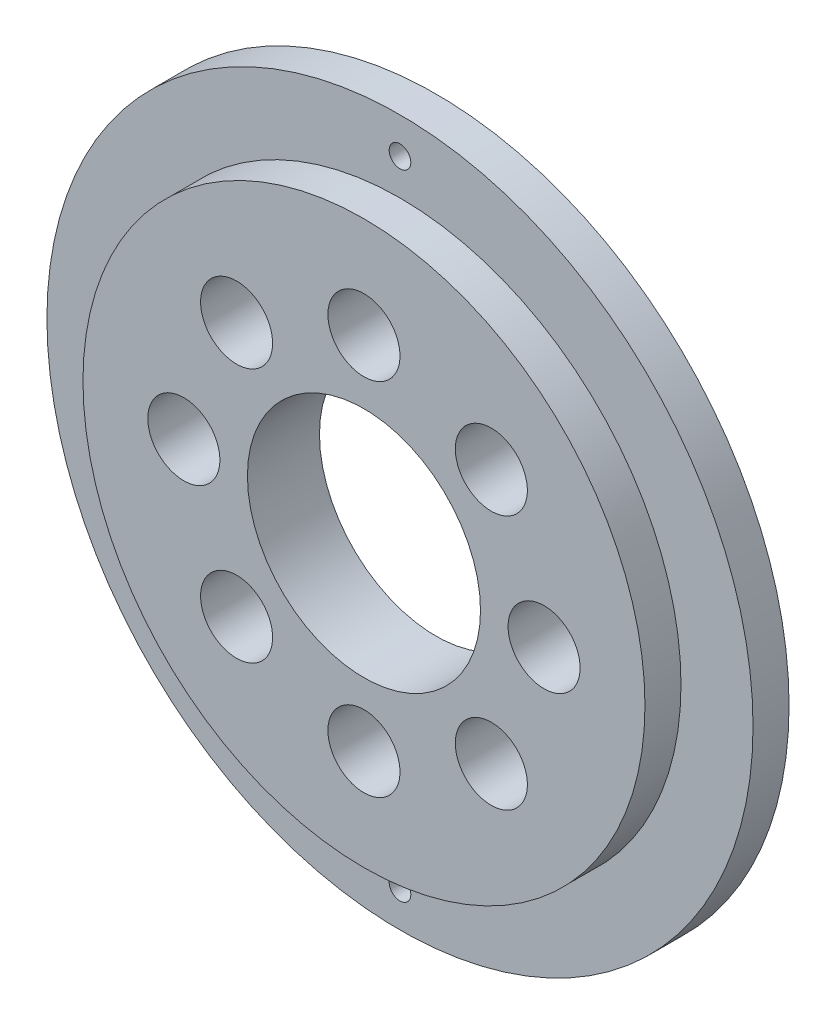
ISO-10303-21;
HEADER;
FILE_DESCRIPTION(('STEP AP214'),'2;1');
FILE_NAME('part.step','',(''),(''),'','','');
FILE_SCHEMA(('AUTOMOTIVE_DESIGN { 1 0 10303 214 1 1 1 1 }'));
ENDSEC;
DATA;
#1=APPLICATION_CONTEXT('core data for automotive mechanical design processes');
#2=APPLICATION_PROTOCOL_DEFINITION('international standard','automotive_design',2000,#1);
#3=PRODUCT_CONTEXT('',#1,'mechanical');
#4=PRODUCT('Part','Part','',(#3));
#5=PRODUCT_RELATED_PRODUCT_CATEGORY('part','',(#4));
#6=PRODUCT_DEFINITION_FORMATION('','',#4);
#7=PRODUCT_DEFINITION_CONTEXT('part definition',#1,'design');
#8=PRODUCT_DEFINITION('design','',#6,#7);
#9=PRODUCT_DEFINITION_SHAPE('','',#8);
#10=(LENGTH_UNIT() NAMED_UNIT(*) SI_UNIT(.MILLI.,.METRE.));
#11=(NAMED_UNIT(*) PLANE_ANGLE_UNIT() SI_UNIT($,.RADIAN.));
#12=(NAMED_UNIT(*) SI_UNIT($,.STERADIAN.) SOLID_ANGLE_UNIT());
#13=UNCERTAINTY_MEASURE_WITH_UNIT(LENGTH_MEASURE(1.E-05),#10,'distance_accuracy_value','');
#14=(GEOMETRIC_REPRESENTATION_CONTEXT(3) GLOBAL_UNCERTAINTY_ASSIGNED_CONTEXT((#13)) GLOBAL_UNIT_ASSIGNED_CONTEXT((#10,
#11,#12)) REPRESENTATION_CONTEXT('',''));
#15=CARTESIAN_POINT('',(0.,0.,0.));
#16=DIRECTION('',(0.,0.,1.));
#17=DIRECTION('',(1.,0.,0.));
#18=AXIS2_PLACEMENT_3D('',#15,#16,#17);
#19=CARTESIAN_POINT('',(0.,0.,5.));
#20=DIRECTION('',(0.,0.,1.));
#21=DIRECTION('',(1.,0.,0.));
#22=AXIS2_PLACEMENT_3D('',#19,#20,#21);
#23=PLANE('',#22);
#24=CARTESIAN_POINT('',(17.6776695296637,17.6776695296637,5.));
#25=DIRECTION('',(0.,0.,-1.));
#26=DIRECTION('',(-1.,0.,0.));
#27=AXIS2_PLACEMENT_3D('',#24,#25,#26);
#28=CIRCLE('',#27,5.);
#29=CARTESIAN_POINT('',(12.6776695296637,17.6776695296637,5.));
#30=VERTEX_POINT('',#29);
#31=EDGE_CURVE('E147',#30,#30,#28,.T.);
#32=ORIENTED_EDGE('',*,*,#31,.T.);
#33=EDGE_LOOP('',(#32));
#34=FACE_BOUND('',#33,.T.);
#35=CARTESIAN_POINT('',(-17.6776695296637,-17.6776695296637,5.));
#36=DIRECTION('',(0.,0.,-1.));
#37=DIRECTION('',(-1.,0.,0.));
#38=AXIS2_PLACEMENT_3D('',#35,#36,#37);
#39=CIRCLE('',#38,5.);
#40=CARTESIAN_POINT('',(-22.6776695296637,-17.6776695296637,5.));
#41=VERTEX_POINT('',#40);
#42=EDGE_CURVE('E155',#41,#41,#39,.T.);
#43=ORIENTED_EDGE('',*,*,#42,.T.);
#44=EDGE_LOOP('',(#43));
#45=FACE_BOUND('',#44,.T.);
#46=CARTESIAN_POINT('',(-17.6776695296637,17.6776695296637,5.));
#47=DIRECTION('',(0.,0.,-1.));
#48=DIRECTION('',(-1.,0.,0.));
#49=AXIS2_PLACEMENT_3D('',#46,#47,#48);
#50=CIRCLE('',#49,5.);
#51=CARTESIAN_POINT('',(-22.6776695296637,17.6776695296637,5.));
#52=VERTEX_POINT('',#51);
#53=EDGE_CURVE('E161',#52,#52,#50,.T.);
#54=ORIENTED_EDGE('',*,*,#53,.T.);
#55=EDGE_LOOP('',(#54));
#56=FACE_BOUND('',#55,.T.);
#57=CARTESIAN_POINT('',(17.6776695296637,-17.6776695296637,5.));
#58=DIRECTION('',(0.,0.,-1.));
#59=DIRECTION('',(-1.,0.,0.));
#60=AXIS2_PLACEMENT_3D('',#57,#58,#59);
#61=CIRCLE('',#60,5.);
#62=CARTESIAN_POINT('',(12.6776695296637,-17.6776695296637,5.));
#63=VERTEX_POINT('',#62);
#64=EDGE_CURVE('E167',#63,#63,#61,.T.);
#65=ORIENTED_EDGE('',*,*,#64,.T.);
#66=EDGE_LOOP('',(#65));
#67=FACE_BOUND('',#66,.T.);
#68=CARTESIAN_POINT('',(0.,-25.,5.));
#69=DIRECTION('',(0.,0.,-1.));
#70=DIRECTION('',(-1.,0.,0.));
#71=AXIS2_PLACEMENT_3D('',#68,#69,#70);
#72=CIRCLE('',#71,5.);
#73=CARTESIAN_POINT('',(-5.,-25.,5.));
#74=VERTEX_POINT('',#73);
#75=EDGE_CURVE('E173',#74,#74,#72,.T.);
#76=ORIENTED_EDGE('',*,*,#75,.T.);
#77=EDGE_LOOP('',(#76));
#78=FACE_BOUND('',#77,.T.);
#79=CARTESIAN_POINT('',(25.,0.,5.));
#80=DIRECTION('',(0.,0.,-1.));
#81=DIRECTION('',(-1.,0.,0.));
#82=AXIS2_PLACEMENT_3D('',#79,#80,#81);
#83=CIRCLE('',#82,5.);
#84=CARTESIAN_POINT('',(20.,0.,5.));
#85=VERTEX_POINT('',#84);
#86=EDGE_CURVE('E179',#85,#85,#83,.T.);
#87=ORIENTED_EDGE('',*,*,#86,.T.);
#88=EDGE_LOOP('',(#87));
#89=FACE_BOUND('',#88,.T.);
#90=CARTESIAN_POINT('',(0.,25.,5.));
#91=DIRECTION('',(0.,0.,-1.));
#92=DIRECTION('',(-1.,0.,0.));
#93=AXIS2_PLACEMENT_3D('',#90,#91,#92);
#94=CIRCLE('',#93,5.);
#95=CARTESIAN_POINT('',(-5.,25.,5.));
#96=VERTEX_POINT('',#95);
#97=EDGE_CURVE('E185',#96,#96,#94,.T.);
#98=ORIENTED_EDGE('',*,*,#97,.T.);
#99=EDGE_LOOP('',(#98));
#100=FACE_BOUND('',#99,.T.);
#101=CARTESIAN_POINT('',(-25.,0.,5.));
#102=DIRECTION('',(0.,0.,-1.));
#103=DIRECTION('',(-1.,0.,0.));
#104=AXIS2_PLACEMENT_3D('',#101,#102,#103);
#105=CIRCLE('',#104,5.);
#106=CARTESIAN_POINT('',(-30.,0.,5.));
#107=VERTEX_POINT('',#106);
#108=EDGE_CURVE('E191',#107,#107,#105,.T.);
#109=ORIENTED_EDGE('',*,*,#108,.T.);
#110=EDGE_LOOP('',(#109));
#111=FACE_BOUND('',#110,.T.);
#112=CARTESIAN_POINT('',(0.,0.,5.));
#113=DIRECTION('',(0.,0.,1.));
#114=DIRECTION('',(1.,0.,0.));
#115=AXIS2_PLACEMENT_3D('',#112,#113,#114);
#116=CIRCLE('',#115,39.);
#117=CARTESIAN_POINT('',(39.,0.,5.));
#118=VERTEX_POINT('',#117);
#119=EDGE_CURVE('E10',#118,#118,#116,.T.);
#120=ORIENTED_EDGE('',*,*,#119,.T.);
#121=EDGE_LOOP('',(#120));
#122=FACE_BOUND('',#121,.T.);
#123=CARTESIAN_POINT('',(0.,0.,5.));
#124=DIRECTION('',(0.,0.,1.));
#125=DIRECTION('',(1.,0.,0.));
#126=AXIS2_PLACEMENT_3D('',#123,#124,#125);
#127=CIRCLE('',#126,16.175);
#128=CARTESIAN_POINT('',(16.175,0.,5.));
#129=VERTEX_POINT('',#128);
#130=EDGE_CURVE('E43',#129,#129,#127,.T.);
#131=ORIENTED_EDGE('',*,*,#130,.F.);
#132=EDGE_LOOP('',(#131));
#133=FACE_BOUND('',#132,.T.);
#134=ADVANCED_FACE('F35',(#34,#45,#56,#67,#78,#89,#100,#111,#122,#133),#23,.T.);
#135=CARTESIAN_POINT('',(0.,0.,5.));
#136=DIRECTION('',(0.,0.,-1.));
#137=DIRECTION('',(-1.,0.,0.));
#138=AXIS2_PLACEMENT_3D('',#135,#136,#137);
#139=CYLINDRICAL_SURFACE('',#138,39.);
#140=ORIENTED_EDGE('',*,*,#119,.F.);
#141=EDGE_LOOP('',(#140));
#142=FACE_BOUND('',#141,.T.);
#143=CARTESIAN_POINT('',(0.,0.,0.));
#144=DIRECTION('',(0.,0.,-1.));
#145=DIRECTION('',(-1.,0.,0.));
#146=AXIS2_PLACEMENT_3D('',#143,#144,#145);
#147=CIRCLE('',#146,39.);
#148=CARTESIAN_POINT('',(-39.,0.,0.));
#149=VERTEX_POINT('',#148);
#150=EDGE_CURVE('E48',#149,#149,#147,.T.);
#151=ORIENTED_EDGE('',*,*,#150,.F.);
#152=EDGE_LOOP('',(#151));
#153=FACE_BOUND('',#152,.T.);
#154=ADVANCED_FACE('F37',(#142,#153),#139,.T.);
#155=CARTESIAN_POINT('',(0.,0.,5.));
#156=DIRECTION('',(0.,0.,-1.));
#157=DIRECTION('',(-1.,0.,0.));
#158=AXIS2_PLACEMENT_3D('',#155,#156,#157);
#159=CYLINDRICAL_SURFACE('',#158,16.175);
#160=ORIENTED_EDGE('',*,*,#130,.T.);
#161=EDGE_LOOP('',(#160));
#162=FACE_BOUND('',#161,.T.);
#163=CARTESIAN_POINT('',(0.,0.,-5.));
#164=DIRECTION('',(0.,0.,-1.));
#165=DIRECTION('',(-1.,0.,0.));
#166=AXIS2_PLACEMENT_3D('',#163,#164,#165);
#167=CIRCLE('',#166,16.175);
#168=CARTESIAN_POINT('',(-16.175,0.,-5.));
#169=VERTEX_POINT('',#168);
#170=EDGE_CURVE('E53',#169,#169,#167,.T.);
#171=ORIENTED_EDGE('',*,*,#170,.T.);
#172=EDGE_LOOP('',(#171));
#173=FACE_BOUND('',#172,.T.);
#174=ADVANCED_FACE('F80',(#162,#173),#159,.F.);
#175=CARTESIAN_POINT('',(0.,0.,-5.));
#176=DIRECTION('',(0.,0.,1.));
#177=DIRECTION('',(1.,0.,0.));
#178=AXIS2_PLACEMENT_3D('',#175,#176,#177);
#179=CYLINDRICAL_SURFACE('',#178,49.);
#180=CARTESIAN_POINT('',(0.,0.,-5.));
#181=DIRECTION('',(0.,0.,-1.));
#182=DIRECTION('',(-1.,0.,0.));
#183=AXIS2_PLACEMENT_3D('',#180,#181,#182);
#184=CIRCLE('',#183,49.);
#185=CARTESIAN_POINT('',(-49.,0.,-5.));
#186=VERTEX_POINT('',#185);
#187=EDGE_CURVE('E69',#186,#186,#184,.T.);
#188=ORIENTED_EDGE('',*,*,#187,.F.);
#189=EDGE_LOOP('',(#188));
#190=FACE_BOUND('',#189,.T.);
#191=CARTESIAN_POINT('',(0.,0.,0.));
#192=DIRECTION('',(0.,0.,-1.));
#193=DIRECTION('',(-1.,0.,0.));
#194=AXIS2_PLACEMENT_3D('',#191,#192,#193);
#195=CIRCLE('',#194,49.);
#196=CARTESIAN_POINT('',(-49.,0.,0.));
#197=VERTEX_POINT('',#196);
#198=EDGE_CURVE('E58',#197,#197,#195,.T.);
#199=ORIENTED_EDGE('',*,*,#198,.T.);
#200=EDGE_LOOP('',(#199));
#201=FACE_BOUND('',#200,.T.);
#202=ADVANCED_FACE('F86',(#190,#201),#179,.T.);
#203=CARTESIAN_POINT('',(0.,0.,-5.));
#204=DIRECTION('',(0.,0.,-1.));
#205=DIRECTION('',(-1.,0.,0.));
#206=AXIS2_PLACEMENT_3D('',#203,#204,#205);
#207=PLANE('',#206);
#208=CARTESIAN_POINT('',(17.6776695296637,17.6776695296637,-5.));
#209=DIRECTION('',(0.,0.,-1.));
#210=DIRECTION('',(-1.,0.,0.));
#211=AXIS2_PLACEMENT_3D('',#208,#209,#210);
#212=CIRCLE('',#211,5.);
#213=CARTESIAN_POINT('',(12.6776695296637,17.6776695296637,-5.));
#214=VERTEX_POINT('',#213);
#215=EDGE_CURVE('E150',#214,#214,#212,.T.);
#216=ORIENTED_EDGE('',*,*,#215,.F.);
#217=EDGE_LOOP('',(#216));
#218=FACE_BOUND('',#217,.T.);
#219=CARTESIAN_POINT('',(-17.6776695296637,-17.6776695296637,-5.));
#220=DIRECTION('',(0.,0.,-1.));
#221=DIRECTION('',(-1.,0.,0.));
#222=AXIS2_PLACEMENT_3D('',#219,#220,#221);
#223=CIRCLE('',#222,5.);
#224=CARTESIAN_POINT('',(-22.6776695296637,-17.6776695296637,-5.));
#225=VERTEX_POINT('',#224);
#226=EDGE_CURVE('E152',#225,#225,#223,.T.);
#227=ORIENTED_EDGE('',*,*,#226,.F.);
#228=EDGE_LOOP('',(#227));
#229=FACE_BOUND('',#228,.T.);
#230=CARTESIAN_POINT('',(-17.6776695296637,17.6776695296637,-5.));
#231=DIRECTION('',(0.,0.,-1.));
#232=DIRECTION('',(-1.,0.,0.));
#233=AXIS2_PLACEMENT_3D('',#230,#231,#232);
#234=CIRCLE('',#233,5.);
#235=CARTESIAN_POINT('',(-22.6776695296637,17.6776695296637,-5.));
#236=VERTEX_POINT('',#235);
#237=EDGE_CURVE('E158',#236,#236,#234,.T.);
#238=ORIENTED_EDGE('',*,*,#237,.F.);
#239=EDGE_LOOP('',(#238));
#240=FACE_BOUND('',#239,.T.);
#241=CARTESIAN_POINT('',(17.6776695296637,-17.6776695296637,-5.));
#242=DIRECTION('',(0.,0.,-1.));
#243=DIRECTION('',(-1.,0.,0.));
#244=AXIS2_PLACEMENT_3D('',#241,#242,#243);
#245=CIRCLE('',#244,5.);
#246=CARTESIAN_POINT('',(12.6776695296637,-17.6776695296637,-5.));
#247=VERTEX_POINT('',#246);
#248=EDGE_CURVE('E164',#247,#247,#245,.T.);
#249=ORIENTED_EDGE('',*,*,#248,.F.);
#250=EDGE_LOOP('',(#249));
#251=FACE_BOUND('',#250,.T.);
#252=CARTESIAN_POINT('',(0.,-25.,-5.));
#253=DIRECTION('',(0.,0.,-1.));
#254=DIRECTION('',(-1.,0.,0.));
#255=AXIS2_PLACEMENT_3D('',#252,#253,#254);
#256=CIRCLE('',#255,5.);
#257=CARTESIAN_POINT('',(-5.,-25.,-5.));
#258=VERTEX_POINT('',#257);
#259=EDGE_CURVE('E170',#258,#258,#256,.T.);
#260=ORIENTED_EDGE('',*,*,#259,.F.);
#261=EDGE_LOOP('',(#260));
#262=FACE_BOUND('',#261,.T.);
#263=CARTESIAN_POINT('',(25.,0.,-5.));
#264=DIRECTION('',(0.,0.,-1.));
#265=DIRECTION('',(-1.,0.,0.));
#266=AXIS2_PLACEMENT_3D('',#263,#264,#265);
#267=CIRCLE('',#266,5.);
#268=CARTESIAN_POINT('',(20.,0.,-5.));
#269=VERTEX_POINT('',#268);
#270=EDGE_CURVE('E176',#269,#269,#267,.T.);
#271=ORIENTED_EDGE('',*,*,#270,.F.);
#272=EDGE_LOOP('',(#271));
#273=FACE_BOUND('',#272,.T.);
#274=CARTESIAN_POINT('',(0.,25.,-5.));
#275=DIRECTION('',(0.,0.,-1.));
#276=DIRECTION('',(-1.,0.,0.));
#277=AXIS2_PLACEMENT_3D('',#274,#275,#276);
#278=CIRCLE('',#277,5.);
#279=CARTESIAN_POINT('',(-5.,25.,-5.));
#280=VERTEX_POINT('',#279);
#281=EDGE_CURVE('E182',#280,#280,#278,.T.);
#282=ORIENTED_EDGE('',*,*,#281,.F.);
#283=EDGE_LOOP('',(#282));
#284=FACE_BOUND('',#283,.T.);
#285=CARTESIAN_POINT('',(-25.,0.,-5.));
#286=DIRECTION('',(0.,0.,-1.));
#287=DIRECTION('',(-1.,0.,0.));
#288=AXIS2_PLACEMENT_3D('',#285,#286,#287);
#289=CIRCLE('',#288,5.);
#290=CARTESIAN_POINT('',(-30.,0.,-5.));
#291=VERTEX_POINT('',#290);
#292=EDGE_CURVE('E188',#291,#291,#289,.T.);
#293=ORIENTED_EDGE('',*,*,#292,.F.);
#294=EDGE_LOOP('',(#293));
#295=FACE_BOUND('',#294,.T.);
#296=CARTESIAN_POINT('',(0.,-44.,-5.));
#297=DIRECTION('',(0.,0.,-1.));
#298=DIRECTION('',(-1.,0.,0.));
#299=AXIS2_PLACEMENT_3D('',#296,#297,#298);
#300=CIRCLE('',#299,1.5);
#301=CARTESIAN_POINT('',(-1.5,-44.,-5.));
#302=VERTEX_POINT('',#301);
#303=EDGE_CURVE('E65',#302,#302,#300,.T.);
#304=ORIENTED_EDGE('',*,*,#303,.F.);
#305=EDGE_LOOP('',(#304));
#306=FACE_BOUND('',#305,.T.);
#307=CARTESIAN_POINT('',(0.,44.,-5.));
#308=DIRECTION('',(0.,0.,-1.));
#309=DIRECTION('',(-1.,0.,0.));
#310=AXIS2_PLACEMENT_3D('',#307,#308,#309);
#311=CIRCLE('',#310,1.5);
#312=CARTESIAN_POINT('',(-1.5,44.,-5.));
#313=VERTEX_POINT('',#312);
#314=EDGE_CURVE('E54',#313,#313,#311,.T.);
#315=ORIENTED_EDGE('',*,*,#314,.F.);
#316=EDGE_LOOP('',(#315));
#317=FACE_BOUND('',#316,.T.);
#318=ORIENTED_EDGE('',*,*,#170,.F.);
#319=EDGE_LOOP('',(#318));
#320=FACE_BOUND('',#319,.T.);
#321=ORIENTED_EDGE('',*,*,#187,.T.);
#322=EDGE_LOOP('',(#321));
#323=FACE_BOUND('',#322,.T.);
#324=ADVANCED_FACE('F97',(#218,#229,#240,#251,#262,#273,#284,#295,#306,#317,#320,#323),#207,.T.);
#325=CARTESIAN_POINT('',(0.,0.,0.));
#326=DIRECTION('',(0.,0.,-1.));
#327=DIRECTION('',(-1.,0.,0.));
#328=AXIS2_PLACEMENT_3D('',#325,#326,#327);
#329=PLANE('',#328);
#330=CARTESIAN_POINT('',(0.,-44.,0.));
#331=DIRECTION('',(0.,0.,-1.));
#332=DIRECTION('',(-1.,0.,0.));
#333=AXIS2_PLACEMENT_3D('',#330,#331,#332);
#334=CIRCLE('',#333,1.5);
#335=CARTESIAN_POINT('',(-1.5,-44.,0.));
#336=VERTEX_POINT('',#335);
#337=EDGE_CURVE('E39',#336,#336,#334,.T.);
#338=ORIENTED_EDGE('',*,*,#337,.T.);
#339=EDGE_LOOP('',(#338));
#340=FACE_BOUND('',#339,.T.);
#341=CARTESIAN_POINT('',(0.,44.,0.));
#342=DIRECTION('',(0.,0.,-1.));
#343=DIRECTION('',(-1.,0.,0.));
#344=AXIS2_PLACEMENT_3D('',#341,#342,#343);
#345=CIRCLE('',#344,1.5);
#346=CARTESIAN_POINT('',(-1.5,44.,0.));
#347=VERTEX_POINT('',#346);
#348=EDGE_CURVE('E51',#347,#347,#345,.T.);
#349=ORIENTED_EDGE('',*,*,#348,.T.);
#350=EDGE_LOOP('',(#349));
#351=FACE_BOUND('',#350,.T.);
#352=ORIENTED_EDGE('',*,*,#150,.T.);
#353=EDGE_LOOP('',(#352));
#354=FACE_BOUND('',#353,.T.);
#355=ORIENTED_EDGE('',*,*,#198,.F.);
#356=EDGE_LOOP('',(#355));
#357=FACE_BOUND('',#356,.T.);
#358=ADVANCED_FACE('F76',(#340,#351,#354,#357),#329,.F.);
#359=CARTESIAN_POINT('',(0.,44.,5.));
#360=DIRECTION('',(0.,0.,-1.));
#361=DIRECTION('',(-1.,0.,0.));
#362=AXIS2_PLACEMENT_3D('',#359,#360,#361);
#363=CYLINDRICAL_SURFACE('',#362,1.5);
#364=ORIENTED_EDGE('',*,*,#314,.T.);
#365=EDGE_LOOP('',(#364));
#366=FACE_BOUND('',#365,.T.);
#367=ORIENTED_EDGE('',*,*,#348,.F.);
#368=EDGE_LOOP('',(#367));
#369=FACE_BOUND('',#368,.T.);
#370=ADVANCED_FACE('F101',(#366,#369),#363,.F.);
#371=CARTESIAN_POINT('',(0.,-44.,5.));
#372=DIRECTION('',(0.,0.,-1.));
#373=DIRECTION('',(-1.,0.,0.));
#374=AXIS2_PLACEMENT_3D('',#371,#372,#373);
#375=CYLINDRICAL_SURFACE('',#374,1.5);
#376=ORIENTED_EDGE('',*,*,#303,.T.);
#377=EDGE_LOOP('',(#376));
#378=FACE_BOUND('',#377,.T.);
#379=ORIENTED_EDGE('',*,*,#337,.F.);
#380=EDGE_LOOP('',(#379));
#381=FACE_BOUND('',#380,.T.);
#382=ADVANCED_FACE('F108',(#378,#381),#375,.F.);
#383=CARTESIAN_POINT('',(-25.,0.,5.));
#384=DIRECTION('',(0.,0.,-1.));
#385=DIRECTION('',(-1.,0.,0.));
#386=AXIS2_PLACEMENT_3D('',#383,#384,#385);
#387=CYLINDRICAL_SURFACE('',#386,5.);
#388=ORIENTED_EDGE('',*,*,#108,.F.);
#389=EDGE_LOOP('',(#388));
#390=FACE_BOUND('',#389,.T.);
#391=ORIENTED_EDGE('',*,*,#292,.T.);
#392=EDGE_LOOP('',(#391));
#393=FACE_BOUND('',#392,.T.);
#394=ADVANCED_FACE('F111',(#390,#393),#387,.F.);
#395=CARTESIAN_POINT('',(0.,25.,5.));
#396=DIRECTION('',(0.,0.,-1.));
#397=DIRECTION('',(-1.,0.,0.));
#398=AXIS2_PLACEMENT_3D('',#395,#396,#397);
#399=CYLINDRICAL_SURFACE('',#398,5.);
#400=ORIENTED_EDGE('',*,*,#97,.F.);
#401=EDGE_LOOP('',(#400));
#402=FACE_BOUND('',#401,.T.);
#403=ORIENTED_EDGE('',*,*,#281,.T.);
#404=EDGE_LOOP('',(#403));
#405=FACE_BOUND('',#404,.T.);
#406=ADVANCED_FACE('F115',(#402,#405),#399,.F.);
#407=CARTESIAN_POINT('',(25.,0.,5.));
#408=DIRECTION('',(0.,0.,-1.));
#409=DIRECTION('',(-1.,0.,0.));
#410=AXIS2_PLACEMENT_3D('',#407,#408,#409);
#411=CYLINDRICAL_SURFACE('',#410,5.);
#412=ORIENTED_EDGE('',*,*,#86,.F.);
#413=EDGE_LOOP('',(#412));
#414=FACE_BOUND('',#413,.T.);
#415=ORIENTED_EDGE('',*,*,#270,.T.);
#416=EDGE_LOOP('',(#415));
#417=FACE_BOUND('',#416,.T.);
#418=ADVANCED_FACE('F119',(#414,#417),#411,.F.);
#419=CARTESIAN_POINT('',(0.,-25.,5.));
#420=DIRECTION('',(0.,0.,-1.));
#421=DIRECTION('',(-1.,0.,0.));
#422=AXIS2_PLACEMENT_3D('',#419,#420,#421);
#423=CYLINDRICAL_SURFACE('',#422,5.);
#424=ORIENTED_EDGE('',*,*,#75,.F.);
#425=EDGE_LOOP('',(#424));
#426=FACE_BOUND('',#425,.T.);
#427=ORIENTED_EDGE('',*,*,#259,.T.);
#428=EDGE_LOOP('',(#427));
#429=FACE_BOUND('',#428,.T.);
#430=ADVANCED_FACE('F123',(#426,#429),#423,.F.);
#431=CARTESIAN_POINT('',(17.6776695296637,-17.6776695296637,5.));
#432=DIRECTION('',(0.,0.,-1.));
#433=DIRECTION('',(-1.,0.,0.));
#434=AXIS2_PLACEMENT_3D('',#431,#432,#433);
#435=CYLINDRICAL_SURFACE('',#434,5.);
#436=ORIENTED_EDGE('',*,*,#64,.F.);
#437=EDGE_LOOP('',(#436));
#438=FACE_BOUND('',#437,.T.);
#439=ORIENTED_EDGE('',*,*,#248,.T.);
#440=EDGE_LOOP('',(#439));
#441=FACE_BOUND('',#440,.T.);
#442=ADVANCED_FACE('F127',(#438,#441),#435,.F.);
#443=CARTESIAN_POINT('',(-17.6776695296637,17.6776695296637,5.));
#444=DIRECTION('',(0.,0.,-1.));
#445=DIRECTION('',(-1.,0.,0.));
#446=AXIS2_PLACEMENT_3D('',#443,#444,#445);
#447=CYLINDRICAL_SURFACE('',#446,5.);
#448=ORIENTED_EDGE('',*,*,#53,.F.);
#449=EDGE_LOOP('',(#448));
#450=FACE_BOUND('',#449,.T.);
#451=ORIENTED_EDGE('',*,*,#237,.T.);
#452=EDGE_LOOP('',(#451));
#453=FACE_BOUND('',#452,.T.);
#454=ADVANCED_FACE('F131',(#450,#453),#447,.F.);
#455=CARTESIAN_POINT('',(-17.6776695296637,-17.6776695296637,5.));
#456=DIRECTION('',(0.,0.,-1.));
#457=DIRECTION('',(-1.,0.,0.));
#458=AXIS2_PLACEMENT_3D('',#455,#456,#457);
#459=CYLINDRICAL_SURFACE('',#458,5.);
#460=ORIENTED_EDGE('',*,*,#42,.F.);
#461=EDGE_LOOP('',(#460));
#462=FACE_BOUND('',#461,.T.);
#463=ORIENTED_EDGE('',*,*,#226,.T.);
#464=EDGE_LOOP('',(#463));
#465=FACE_BOUND('',#464,.T.);
#466=ADVANCED_FACE('F135',(#462,#465),#459,.F.);
#467=CARTESIAN_POINT('',(17.6776695296637,17.6776695296637,5.));
#468=DIRECTION('',(0.,0.,-1.));
#469=DIRECTION('',(-1.,0.,0.));
#470=AXIS2_PLACEMENT_3D('',#467,#468,#469);
#471=CYLINDRICAL_SURFACE('',#470,5.);
#472=ORIENTED_EDGE('',*,*,#31,.F.);
#473=EDGE_LOOP('',(#472));
#474=FACE_BOUND('',#473,.T.);
#475=ORIENTED_EDGE('',*,*,#215,.T.);
#476=EDGE_LOOP('',(#475));
#477=FACE_BOUND('',#476,.T.);
#478=ADVANCED_FACE('F139',(#474,#477),#471,.F.);
#479=CLOSED_SHELL('',(#134,#154,#174,#202,#324,#358,#370,#382,#394,#406,#418,#430,#442,#454,
#466,#478));
#480=MANIFOLD_SOLID_BREP('B2',#479);
#481=ADVANCED_BREP_SHAPE_REPRESENTATION('',(#18,#480),#14);
#482=SHAPE_DEFINITION_REPRESENTATION(#9,#481);
ENDSEC;
END-ISO-10303-21;
